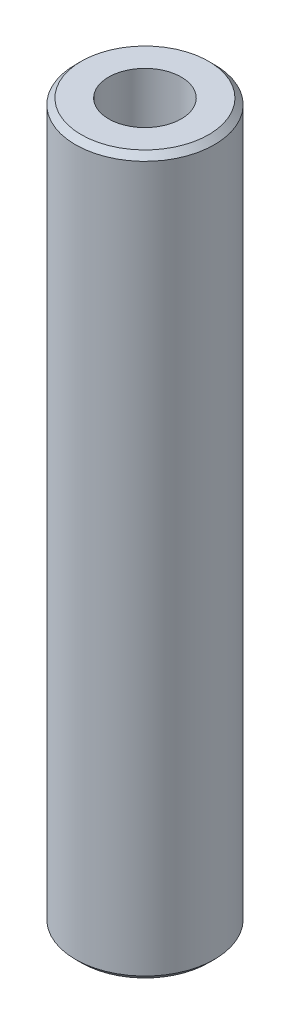
ISO-10303-21;
HEADER;
FILE_DESCRIPTION(('STEP AP214'),'2;1');
FILE_NAME('part.step','',(''),(''),'','','');
FILE_SCHEMA(('AUTOMOTIVE_DESIGN { 1 0 10303 214 1 1 1 1 }'));
ENDSEC;
DATA;
#1=APPLICATION_CONTEXT('core data for automotive mechanical design processes');
#2=APPLICATION_PROTOCOL_DEFINITION('international standard','automotive_design',2000,#1);
#3=PRODUCT_CONTEXT('',#1,'mechanical');
#4=PRODUCT('Part','Part','',(#3));
#5=PRODUCT_RELATED_PRODUCT_CATEGORY('part','',(#4));
#6=PRODUCT_DEFINITION_FORMATION('','',#4);
#7=PRODUCT_DEFINITION_CONTEXT('part definition',#1,'design');
#8=PRODUCT_DEFINITION('design','',#6,#7);
#9=PRODUCT_DEFINITION_SHAPE('','',#8);
#10=(LENGTH_UNIT() NAMED_UNIT(*) SI_UNIT(.MILLI.,.METRE.));
#11=(NAMED_UNIT(*) PLANE_ANGLE_UNIT() SI_UNIT($,.RADIAN.));
#12=(NAMED_UNIT(*) SI_UNIT($,.STERADIAN.) SOLID_ANGLE_UNIT());
#13=UNCERTAINTY_MEASURE_WITH_UNIT(LENGTH_MEASURE(1.E-05),#10,'distance_accuracy_value','');
#14=(GEOMETRIC_REPRESENTATION_CONTEXT(3) GLOBAL_UNCERTAINTY_ASSIGNED_CONTEXT((#13)) GLOBAL_UNIT_ASSIGNED_CONTEXT((#10,
#11,#12)) REPRESENTATION_CONTEXT('',''));
#15=CARTESIAN_POINT('',(0.,0.,0.));
#16=DIRECTION('',(0.,0.,1.));
#17=DIRECTION('',(1.,0.,0.));
#18=AXIS2_PLACEMENT_3D('',#15,#16,#17);
#19=CARTESIAN_POINT('',(0.,24.5872,0.));
#20=DIRECTION('',(0.,-1.,0.));
#21=DIRECTION('',(0.,0.,-1.));
#22=AXIS2_PLACEMENT_3D('',#19,#20,#21);
#23=CYLINDRICAL_SURFACE('',#22,4.7625);
#24=CARTESIAN_POINT('',(0.,-24.190325,0.));
#25=DIRECTION('',(0.,1.,0.));
#26=DIRECTION('',(0.,0.,1.));
#27=AXIS2_PLACEMENT_3D('',#24,#25,#26);
#28=CIRCLE('',#27,4.7625);
#29=CARTESIAN_POINT('',(0.,-24.190325,4.7625));
#30=VERTEX_POINT('',#29);
#31=EDGE_CURVE('E45',#30,#30,#28,.T.);
#32=ORIENTED_EDGE('',*,*,#31,.T.);
#33=EDGE_LOOP('',(#32));
#34=FACE_BOUND('',#33,.T.);
#35=CARTESIAN_POINT('',(0.,24.190325,0.));
#36=DIRECTION('',(0.,1.,0.));
#37=DIRECTION('',(0.,0.,1.));
#38=AXIS2_PLACEMENT_3D('',#35,#36,#37);
#39=CIRCLE('',#38,4.7625);
#40=CARTESIAN_POINT('',(0.,24.190325,4.7625));
#41=VERTEX_POINT('',#40);
#42=EDGE_CURVE('E49',#41,#41,#39,.F.);
#43=ORIENTED_EDGE('',*,*,#42,.T.);
#44=EDGE_LOOP('',(#43));
#45=FACE_BOUND('',#44,.T.);
#46=ADVANCED_FACE('F33',(#34,#45),#23,.T.);
#47=CARTESIAN_POINT('',(0.,24.5872,0.));
#48=DIRECTION('',(0.,1.,0.));
#49=DIRECTION('',(0.,0.,1.));
#50=AXIS2_PLACEMENT_3D('',#47,#48,#49);
#51=PLANE('',#50);
#52=CARTESIAN_POINT('',(0.,24.5872,0.));
#53=DIRECTION('',(0.,1.,0.));
#54=DIRECTION('',(0.,0.,1.));
#55=AXIS2_PLACEMENT_3D('',#52,#53,#54);
#56=CIRCLE('',#55,2.4892);
#57=CARTESIAN_POINT('',(0.,24.5872,2.4892));
#58=VERTEX_POINT('',#57);
#59=EDGE_CURVE('E57',#58,#58,#56,.T.);
#60=ORIENTED_EDGE('',*,*,#59,.F.);
#61=EDGE_LOOP('',(#60));
#62=FACE_BOUND('',#61,.T.);
#63=CARTESIAN_POINT('',(0.,24.5872,0.));
#64=DIRECTION('',(0.,1.,0.));
#65=DIRECTION('',(0.,0.,1.));
#66=AXIS2_PLACEMENT_3D('',#63,#64,#65);
#67=CIRCLE('',#66,4.365625);
#68=CARTESIAN_POINT('',(0.,24.5872,4.365625));
#69=VERTEX_POINT('',#68);
#70=EDGE_CURVE('E10',#69,#69,#67,.T.);
#71=ORIENTED_EDGE('',*,*,#70,.T.);
#72=EDGE_LOOP('',(#71));
#73=FACE_BOUND('',#72,.T.);
#74=ADVANCED_FACE('F63',(#62,#73),#51,.T.);
#75=CARTESIAN_POINT('',(0.,-24.5872,0.));
#76=DIRECTION('',(0.,1.,0.));
#77=DIRECTION('',(0.,0.,1.));
#78=AXIS2_PLACEMENT_3D('',#75,#76,#77);
#79=PLANE('',#78);
#80=CARTESIAN_POINT('',(0.,-24.5872,0.));
#81=DIRECTION('',(0.,1.,0.));
#82=DIRECTION('',(0.,0.,1.));
#83=AXIS2_PLACEMENT_3D('',#80,#81,#82);
#84=CIRCLE('',#83,2.4892);
#85=CARTESIAN_POINT('',(0.,-24.5872,2.4892));
#86=VERTEX_POINT('',#85);
#87=EDGE_CURVE('E54',#86,#86,#84,.T.);
#88=ORIENTED_EDGE('',*,*,#87,.T.);
#89=EDGE_LOOP('',(#88));
#90=FACE_BOUND('',#89,.T.);
#91=CARTESIAN_POINT('',(0.,-24.5872,0.));
#92=DIRECTION('',(0.,1.,0.));
#93=DIRECTION('',(0.,0.,1.));
#94=AXIS2_PLACEMENT_3D('',#91,#92,#93);
#95=CIRCLE('',#94,4.36562499999998);
#96=CARTESIAN_POINT('',(0.,-24.5872,4.36562499999998));
#97=VERTEX_POINT('',#96);
#98=EDGE_CURVE('E41',#97,#97,#95,.F.);
#99=ORIENTED_EDGE('',*,*,#98,.T.);
#100=EDGE_LOOP('',(#99));
#101=FACE_BOUND('',#100,.T.);
#102=ADVANCED_FACE('F65',(#90,#101),#79,.F.);
#103=CARTESIAN_POINT('',(0.,-24.190325,0.));
#104=DIRECTION('',(0.,1.,0.));
#105=DIRECTION('',(0.,0.,1.));
#106=AXIS2_PLACEMENT_3D('',#103,#104,#105);
#107=CONICAL_SURFACE('',#106,4.7625,0.785398163397445);
#108=ORIENTED_EDGE('',*,*,#98,.F.);
#109=EDGE_LOOP('',(#108));
#110=FACE_BOUND('',#109,.T.);
#111=ORIENTED_EDGE('',*,*,#31,.F.);
#112=EDGE_LOOP('',(#111));
#113=FACE_BOUND('',#112,.T.);
#114=ADVANCED_FACE('F71',(#110,#113),#107,.T.);
#115=CARTESIAN_POINT('',(0.,24.5872,0.));
#116=DIRECTION('',(0.,-1.,0.));
#117=DIRECTION('',(0.,0.,-1.));
#118=AXIS2_PLACEMENT_3D('',#115,#116,#117);
#119=CONICAL_SURFACE('',#118,4.365625,0.785398163397449);
#120=ORIENTED_EDGE('',*,*,#42,.F.);
#121=EDGE_LOOP('',(#120));
#122=FACE_BOUND('',#121,.T.);
#123=ORIENTED_EDGE('',*,*,#70,.F.);
#124=EDGE_LOOP('',(#123));
#125=FACE_BOUND('',#124,.T.);
#126=ADVANCED_FACE('F36',(#122,#125),#119,.T.);
#127=CARTESIAN_POINT('',(0.,-24.5872,0.));
#128=DIRECTION('',(0.,1.,0.));
#129=DIRECTION('',(0.,0.,1.));
#130=AXIS2_PLACEMENT_3D('',#127,#128,#129);
#131=CYLINDRICAL_SURFACE('',#130,2.4892);
#132=ORIENTED_EDGE('',*,*,#87,.F.);
#133=EDGE_LOOP('',(#132));
#134=FACE_BOUND('',#133,.T.);
#135=ORIENTED_EDGE('',*,*,#59,.T.);
#136=EDGE_LOOP('',(#135));
#137=FACE_BOUND('',#136,.T.);
#138=ADVANCED_FACE('F61',(#134,#137),#131,.F.);
#139=CLOSED_SHELL('',(#46,#74,#102,#114,#126,#138));
#140=MANIFOLD_SOLID_BREP('B2',#139);
#141=ADVANCED_BREP_SHAPE_REPRESENTATION('',(#18,#140),#14);
#142=SHAPE_DEFINITION_REPRESENTATION(#9,#141);
ENDSEC;
END-ISO-10303-21;
